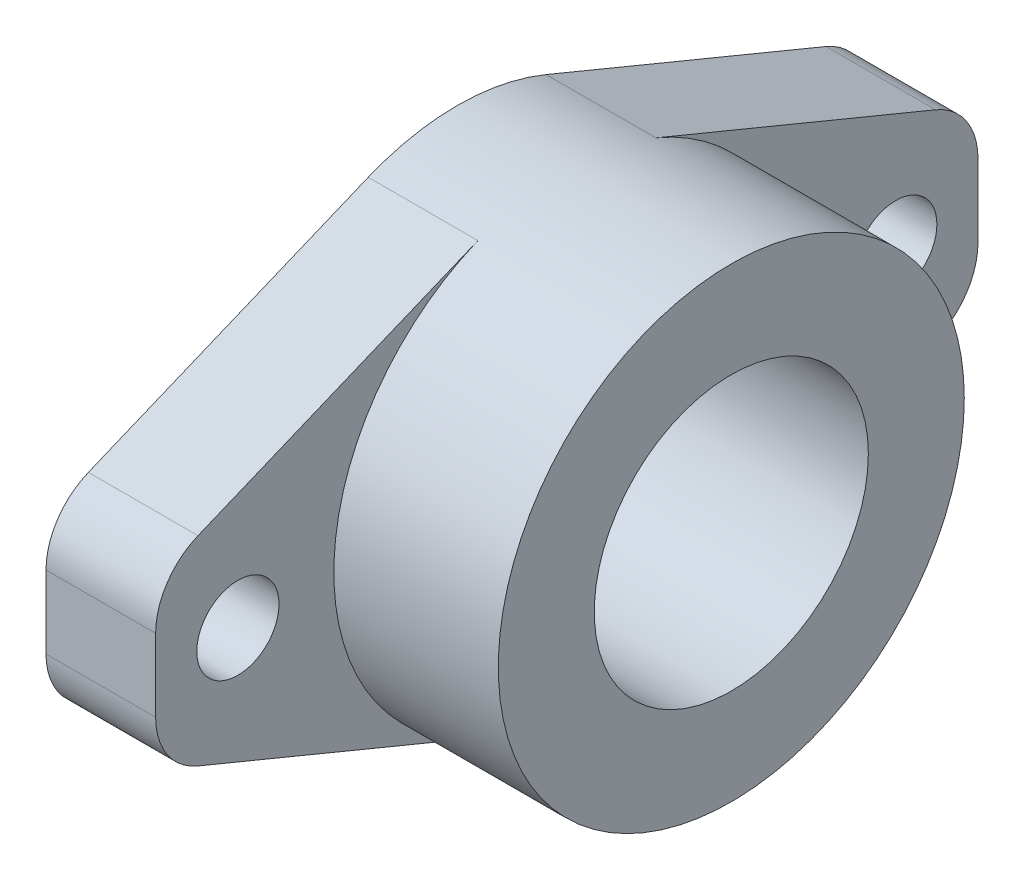
ISO-10303-21;
HEADER;
FILE_DESCRIPTION(('STEP AP214'),'2;1');
FILE_NAME('part.step','',(''),(''),'','','');
FILE_SCHEMA(('AUTOMOTIVE_DESIGN { 1 0 10303 214 1 1 1 1 }'));
ENDSEC;
DATA;
#1=APPLICATION_CONTEXT('core data for automotive mechanical design processes');
#2=APPLICATION_PROTOCOL_DEFINITION('international standard','automotive_design',2000,#1);
#3=PRODUCT_CONTEXT('',#1,'mechanical');
#4=PRODUCT('Part','Part','',(#3));
#5=PRODUCT_RELATED_PRODUCT_CATEGORY('part','',(#4));
#6=PRODUCT_DEFINITION_FORMATION('','',#4);
#7=PRODUCT_DEFINITION_CONTEXT('part definition',#1,'design');
#8=PRODUCT_DEFINITION('design','',#6,#7);
#9=PRODUCT_DEFINITION_SHAPE('','',#8);
#10=(LENGTH_UNIT() NAMED_UNIT(*) SI_UNIT(.MILLI.,.METRE.));
#11=(NAMED_UNIT(*) PLANE_ANGLE_UNIT() SI_UNIT($,.RADIAN.));
#12=(NAMED_UNIT(*) SI_UNIT($,.STERADIAN.) SOLID_ANGLE_UNIT());
#13=UNCERTAINTY_MEASURE_WITH_UNIT(LENGTH_MEASURE(1.E-05),#10,'distance_accuracy_value','');
#14=(GEOMETRIC_REPRESENTATION_CONTEXT(3) GLOBAL_UNCERTAINTY_ASSIGNED_CONTEXT((#13)) GLOBAL_UNIT_ASSIGNED_CONTEXT((#10,
#11,#12)) REPRESENTATION_CONTEXT('',''));
#15=CARTESIAN_POINT('',(0.,0.,0.));
#16=DIRECTION('',(0.,0.,1.));
#17=DIRECTION('',(1.,0.,0.));
#18=AXIS2_PLACEMENT_3D('',#15,#16,#17);
#19=CARTESIAN_POINT('',(8.,0.,0.));
#20=DIRECTION('',(1.,0.,0.));
#21=DIRECTION('',(0.,0.,-1.));
#22=AXIS2_PLACEMENT_3D('',#19,#20,#21);
#23=PLANE('',#22);
#24=CARTESIAN_POINT('',(8.,0.,24.));
#25=DIRECTION('',(1.,0.,0.));
#26=DIRECTION('',(0.,0.,-1.));
#27=AXIS2_PLACEMENT_3D('',#24,#25,#26);
#28=CIRCLE('',#27,3.);
#29=CARTESIAN_POINT('',(8.,0.,21.));
#30=VERTEX_POINT('',#29);
#31=EDGE_CURVE('E249',#30,#30,#28,.T.);
#32=ORIENTED_EDGE('',*,*,#31,.F.);
#33=EDGE_LOOP('',(#32));
#34=FACE_BOUND('',#33,.T.);
#35=DIRECTION('',(0.,-1.,0.));
#36=VECTOR('',#35,1.);
#37=CARTESIAN_POINT('',(8.,-6.,30.));
#38=LINE('',#37,#36);
#39=CARTESIAN_POINT('',(8.,2.65572396979215,30.));
#40=VERTEX_POINT('',#39);
#41=CARTESIAN_POINT('',(8.,-2.65572396979215,30.));
#42=VERTEX_POINT('',#41);
#43=EDGE_CURVE('E214',#40,#42,#38,.T.);
#44=ORIENTED_EDGE('',*,*,#43,.T.);
#45=CARTESIAN_POINT('',(8.,-2.65572396979215,25.));
#46=DIRECTION('',(1.,0.,0.));
#47=DIRECTION('',(0.,0.,-1.));
#48=AXIS2_PLACEMENT_3D('',#45,#46,#47);
#49=CIRCLE('',#48,5.);
#50=CARTESIAN_POINT('',(8.,-7.27690901529757,26.9090963242322));
#51=VERTEX_POINT('',#50);
#52=EDGE_CURVE('E176',#42,#51,#49,.T.);
#53=ORIENTED_EDGE('',*,*,#52,.T.);
#54=DIRECTION('',(0.,-0.38181926484645,-0.924237009101084));
#55=VECTOR('',#54,1.);
#56=CARTESIAN_POINT('',(8.,-6.,30.));
#57=LINE('',#56,#55);
#58=CARTESIAN_POINT('',(8.,-15.7120291547184,6.49092750238964));
#59=VERTEX_POINT('',#58);
#60=EDGE_CURVE('E220',#51,#59,#57,.T.);
#61=ORIENTED_EDGE('',*,*,#60,.T.);
#62=CARTESIAN_POINT('',(8.,0.,0.));
#63=DIRECTION('',(1.,0.,0.));
#64=DIRECTION('',(0.,0.,-1.));
#65=AXIS2_PLACEMENT_3D('',#62,#63,#64);
#66=CIRCLE('',#65,17.);
#67=CARTESIAN_POINT('',(8.,15.7120291547184,6.49092750238966));
#68=VERTEX_POINT('',#67);
#69=EDGE_CURVE('E143',#59,#68,#66,.F.);
#70=ORIENTED_EDGE('',*,*,#69,.T.);
#71=DIRECTION('',(0.,-0.38181926484645,0.924237009101084));
#72=VECTOR('',#71,1.);
#73=CARTESIAN_POINT('',(8.,6.,30.));
#74=LINE('',#73,#72);
#75=CARTESIAN_POINT('',(8.,7.27690901529756,26.9090963242322));
#76=VERTEX_POINT('',#75);
#77=EDGE_CURVE('E211',#68,#76,#74,.T.);
#78=ORIENTED_EDGE('',*,*,#77,.T.);
#79=CARTESIAN_POINT('',(8.,2.65572396979215,25.));
#80=DIRECTION('',(1.,0.,0.));
#81=DIRECTION('',(0.,0.,-1.));
#82=AXIS2_PLACEMENT_3D('',#79,#80,#81);
#83=CIRCLE('',#82,5.);
#84=EDGE_CURVE('E174',#76,#40,#83,.T.);
#85=ORIENTED_EDGE('',*,*,#84,.T.);
#86=EDGE_LOOP('',(#44,#53,#61,#70,#78,#85));
#87=FACE_BOUND('',#86,.T.);
#88=ADVANCED_FACE('F32',(#34,#87),#23,.T.);
#89=CARTESIAN_POINT('',(8.,0.,-24.));
#90=DIRECTION('',(1.,0.,0.));
#91=DIRECTION('',(0.,0.,-1.));
#92=AXIS2_PLACEMENT_3D('',#89,#90,#91);
#93=CIRCLE('',#92,3.);
#94=CARTESIAN_POINT('',(8.,0.,-27.));
#95=VERTEX_POINT('',#94);
#96=EDGE_CURVE('E241',#95,#95,#93,.T.);
#97=ORIENTED_EDGE('',*,*,#96,.F.);
#98=EDGE_LOOP('',(#97));
#99=FACE_BOUND('',#98,.T.);
#100=DIRECTION('',(0.,1.,0.));
#101=VECTOR('',#100,1.);
#102=CARTESIAN_POINT('',(8.,-6.,-30.));
#103=LINE('',#102,#101);
#104=CARTESIAN_POINT('',(8.,-2.65572396979215,-30.));
#105=VERTEX_POINT('',#104);
#106=CARTESIAN_POINT('',(8.,2.65572396979215,-30.));
#107=VERTEX_POINT('',#106);
#108=EDGE_CURVE('E133',#105,#107,#103,.T.);
#109=ORIENTED_EDGE('',*,*,#108,.T.);
#110=CARTESIAN_POINT('',(8.,2.65572396979215,-25.));
#111=DIRECTION('',(1.,0.,0.));
#112=DIRECTION('',(0.,0.,-1.));
#113=AXIS2_PLACEMENT_3D('',#110,#111,#112);
#114=CIRCLE('',#113,5.);
#115=CARTESIAN_POINT('',(8.,7.27690901529757,-26.9090963242323));
#116=VERTEX_POINT('',#115);
#117=EDGE_CURVE('E40',#107,#116,#114,.T.);
#118=ORIENTED_EDGE('',*,*,#117,.T.);
#119=DIRECTION('',(0.,0.38181926484645,0.924237009101084));
#120=VECTOR('',#119,1.);
#121=CARTESIAN_POINT('',(8.,6.,-30.));
#122=LINE('',#121,#120);
#123=CARTESIAN_POINT('',(8.,15.7120291547184,-6.49092750238965));
#124=VERTEX_POINT('',#123);
#125=EDGE_CURVE('E122',#116,#124,#122,.T.);
#126=ORIENTED_EDGE('',*,*,#125,.T.);
#127=CARTESIAN_POINT('',(8.,-15.7120291547184,-6.49092750238965));
#128=VERTEX_POINT('',#127);
#129=EDGE_CURVE('E125',#124,#128,#66,.F.);
#130=ORIENTED_EDGE('',*,*,#129,.T.);
#131=DIRECTION('',(0.,0.38181926484645,-0.924237009101083));
#132=VECTOR('',#131,1.);
#133=CARTESIAN_POINT('',(8.,-6.,-30.));
#134=LINE('',#133,#132);
#135=CARTESIAN_POINT('',(8.,-7.27690901529756,-26.9090963242323));
#136=VERTEX_POINT('',#135);
#137=EDGE_CURVE('E188',#128,#136,#134,.T.);
#138=ORIENTED_EDGE('',*,*,#137,.T.);
#139=CARTESIAN_POINT('',(8.,-2.65572396979215,-25.));
#140=DIRECTION('',(1.,0.,0.));
#141=DIRECTION('',(0.,0.,-1.));
#142=AXIS2_PLACEMENT_3D('',#139,#140,#141);
#143=CIRCLE('',#142,5.);
#144=EDGE_CURVE('E186',#136,#105,#143,.T.);
#145=ORIENTED_EDGE('',*,*,#144,.T.);
#146=EDGE_LOOP('',(#109,#118,#126,#130,#138,#145));
#147=FACE_BOUND('',#146,.T.);
#148=ADVANCED_FACE('F124',(#99,#147),#23,.T.);
#149=CARTESIAN_POINT('',(0.,0.,0.));
#150=DIRECTION('',(1.,0.,0.));
#151=DIRECTION('',(0.,0.,-1.));
#152=AXIS2_PLACEMENT_3D('',#149,#150,#151);
#153=PLANE('',#152);
#154=DIRECTION('',(0.,-0.38181926484645,-0.924237009101084));
#155=VECTOR('',#154,1.);
#156=CARTESIAN_POINT('',(0.,-6.,30.));
#157=LINE('',#156,#155);
#158=CARTESIAN_POINT('',(0.,-7.27690901529757,26.9090963242322));
#159=VERTEX_POINT('',#158);
#160=CARTESIAN_POINT('',(0.,-15.7120291547184,6.49092750238964));
#161=VERTEX_POINT('',#160);
#162=EDGE_CURVE('E206',#159,#161,#157,.T.);
#163=ORIENTED_EDGE('',*,*,#162,.F.);
#164=CARTESIAN_POINT('',(0.,-2.65572396979215,25.));
#165=DIRECTION('',(1.,0.,0.));
#166=DIRECTION('',(0.,0.,-1.));
#167=AXIS2_PLACEMENT_3D('',#164,#165,#166);
#168=CIRCLE('',#167,5.);
#169=CARTESIAN_POINT('',(0.,-2.65572396979215,30.));
#170=VERTEX_POINT('',#169);
#171=EDGE_CURVE('E167',#159,#170,#168,.F.);
#172=ORIENTED_EDGE('',*,*,#171,.T.);
#173=DIRECTION('',(0.,-1.,0.));
#174=VECTOR('',#173,1.);
#175=CARTESIAN_POINT('',(0.,-6.,30.));
#176=LINE('',#175,#174);
#177=CARTESIAN_POINT('',(0.,2.65572396979215,30.));
#178=VERTEX_POINT('',#177);
#179=EDGE_CURVE('E231',#178,#170,#176,.T.);
#180=ORIENTED_EDGE('',*,*,#179,.F.);
#181=CARTESIAN_POINT('',(0.,2.65572396979215,25.));
#182=DIRECTION('',(1.,0.,0.));
#183=DIRECTION('',(0.,0.,-1.));
#184=AXIS2_PLACEMENT_3D('',#181,#182,#183);
#185=CIRCLE('',#184,5.);
#186=CARTESIAN_POINT('',(0.,7.27690901529756,26.9090963242322));
#187=VERTEX_POINT('',#186);
#188=EDGE_CURVE('E165',#178,#187,#185,.F.);
#189=ORIENTED_EDGE('',*,*,#188,.T.);
#190=DIRECTION('',(0.,-0.38181926484645,0.924237009101084));
#191=VECTOR('',#190,1.);
#192=CARTESIAN_POINT('',(0.,6.,30.));
#193=LINE('',#192,#191);
#194=CARTESIAN_POINT('',(0.,15.7120291547184,6.49092750238965));
#195=VERTEX_POINT('',#194);
#196=EDGE_CURVE('E228',#195,#187,#193,.T.);
#197=ORIENTED_EDGE('',*,*,#196,.F.);
#198=CARTESIAN_POINT('',(0.,0.,0.));
#199=DIRECTION('',(1.,0.,0.));
#200=DIRECTION('',(0.,0.,-1.));
#201=AXIS2_PLACEMENT_3D('',#198,#199,#200);
#202=CIRCLE('',#201,17.);
#203=CARTESIAN_POINT('',(0.,15.7120291547184,-6.49092750238965));
#204=VERTEX_POINT('',#203);
#205=EDGE_CURVE('E210',#204,#195,#202,.T.);
#206=ORIENTED_EDGE('',*,*,#205,.F.);
#207=DIRECTION('',(0.,0.38181926484645,0.924237009101084));
#208=VECTOR('',#207,1.);
#209=CARTESIAN_POINT('',(0.,6.,-30.));
#210=LINE('',#209,#208);
#211=CARTESIAN_POINT('',(0.,7.27690901529757,-26.9090963242323));
#212=VERTEX_POINT('',#211);
#213=EDGE_CURVE('E148',#212,#204,#210,.T.);
#214=ORIENTED_EDGE('',*,*,#213,.F.);
#215=CARTESIAN_POINT('',(0.,2.65572396979215,-25.));
#216=DIRECTION('',(1.,0.,0.));
#217=DIRECTION('',(0.,0.,-1.));
#218=AXIS2_PLACEMENT_3D('',#215,#216,#217);
#219=CIRCLE('',#218,5.);
#220=CARTESIAN_POINT('',(0.,2.65572396979215,-30.));
#221=VERTEX_POINT('',#220);
#222=EDGE_CURVE('E163',#212,#221,#219,.F.);
#223=ORIENTED_EDGE('',*,*,#222,.T.);
#224=DIRECTION('',(0.,1.,0.));
#225=VECTOR('',#224,1.);
#226=CARTESIAN_POINT('',(0.,-6.,-30.));
#227=LINE('',#226,#225);
#228=CARTESIAN_POINT('',(0.,-2.65572396979215,-30.));
#229=VERTEX_POINT('',#228);
#230=EDGE_CURVE('E201',#229,#221,#227,.T.);
#231=ORIENTED_EDGE('',*,*,#230,.F.);
#232=CARTESIAN_POINT('',(0.,-2.65572396979215,-25.));
#233=DIRECTION('',(1.,0.,0.));
#234=DIRECTION('',(0.,0.,-1.));
#235=AXIS2_PLACEMENT_3D('',#232,#233,#234);
#236=CIRCLE('',#235,5.);
#237=CARTESIAN_POINT('',(0.,-7.27690901529756,-26.9090963242323));
#238=VERTEX_POINT('',#237);
#239=EDGE_CURVE('E161',#229,#238,#236,.F.);
#240=ORIENTED_EDGE('',*,*,#239,.T.);
#241=DIRECTION('',(0.,0.38181926484645,-0.924237009101083));
#242=VECTOR('',#241,1.);
#243=CARTESIAN_POINT('',(0.,-6.,-30.));
#244=LINE('',#243,#242);
#245=CARTESIAN_POINT('',(0.,-15.7120291547184,-6.49092750238965));
#246=VERTEX_POINT('',#245);
#247=EDGE_CURVE('E200',#246,#238,#244,.T.);
#248=ORIENTED_EDGE('',*,*,#247,.F.);
#249=CARTESIAN_POINT('',(0.,0.,0.));
#250=DIRECTION('',(1.,0.,0.));
#251=DIRECTION('',(0.,0.,-1.));
#252=AXIS2_PLACEMENT_3D('',#249,#250,#251);
#253=CIRCLE('',#252,17.);
#254=EDGE_CURVE('E203',#161,#246,#253,.T.);
#255=ORIENTED_EDGE('',*,*,#254,.F.);
#256=EDGE_LOOP('',(#163,#172,#180,#189,#197,#206,#214,#223,#231,#240,#248,#255));
#257=FACE_BOUND('',#256,.T.);
#258=CARTESIAN_POINT('',(0.,0.,0.));
#259=DIRECTION('',(1.,0.,0.));
#260=DIRECTION('',(0.,0.,-1.));
#261=AXIS2_PLACEMENT_3D('',#258,#259,#260);
#262=CIRCLE('',#261,10.);
#263=CARTESIAN_POINT('',(0.,0.,-10.));
#264=VERTEX_POINT('',#263);
#265=EDGE_CURVE('E223',#264,#264,#262,.T.);
#266=ORIENTED_EDGE('',*,*,#265,.T.);
#267=EDGE_LOOP('',(#266));
#268=FACE_BOUND('',#267,.T.);
#269=CARTESIAN_POINT('',(0.,0.,-24.));
#270=DIRECTION('',(1.,0.,0.));
#271=DIRECTION('',(0.,0.,-1.));
#272=AXIS2_PLACEMENT_3D('',#269,#270,#271);
#273=CIRCLE('',#272,3.);
#274=CARTESIAN_POINT('',(0.,0.,-27.));
#275=VERTEX_POINT('',#274);
#276=EDGE_CURVE('E239',#275,#275,#273,.T.);
#277=ORIENTED_EDGE('',*,*,#276,.T.);
#278=EDGE_LOOP('',(#277));
#279=FACE_BOUND('',#278,.T.);
#280=CARTESIAN_POINT('',(0.,0.,24.));
#281=DIRECTION('',(1.,0.,0.));
#282=DIRECTION('',(0.,0.,-1.));
#283=AXIS2_PLACEMENT_3D('',#280,#281,#282);
#284=CIRCLE('',#283,3.);
#285=CARTESIAN_POINT('',(0.,0.,21.));
#286=VERTEX_POINT('',#285);
#287=EDGE_CURVE('E247',#286,#286,#284,.T.);
#288=ORIENTED_EDGE('',*,*,#287,.T.);
#289=EDGE_LOOP('',(#288));
#290=FACE_BOUND('',#289,.T.);
#291=ADVANCED_FACE('F197',(#257,#268,#279,#290),#153,.F.);
#292=CARTESIAN_POINT('',(8.,6.,30.));
#293=DIRECTION('',(0.,-0.924237009101084,-0.38181926484645));
#294=DIRECTION('',(0.,0.38181926484645,-0.924237009101084));
#295=AXIS2_PLACEMENT_3D('',#292,#293,#294);
#296=PLANE('',#295);
#297=ORIENTED_EDGE('',*,*,#196,.T.);
#298=DIRECTION('',(-1.,0.,0.));
#299=VECTOR('',#298,1.);
#300=CARTESIAN_POINT('',(8.,7.27690901529756,26.9090963242322));
#301=LINE('',#300,#299);
#302=EDGE_CURVE('E178',#187,#76,#301,.F.);
#303=ORIENTED_EDGE('',*,*,#302,.T.);
#304=ORIENTED_EDGE('',*,*,#77,.F.);
#305=DIRECTION('',(-1.,0.,0.));
#306=VECTOR('',#305,1.);
#307=CARTESIAN_POINT('',(8.,15.7120291547184,6.49092750238965));
#308=LINE('',#307,#306);
#309=EDGE_CURVE('E132',#68,#195,#308,.T.);
#310=ORIENTED_EDGE('',*,*,#309,.T.);
#311=EDGE_LOOP('',(#297,#303,#304,#310));
#312=FACE_BOUND('',#311,.T.);
#313=ADVANCED_FACE('F281',(#312),#296,.F.);
#314=CARTESIAN_POINT('',(8.,-6.,30.));
#315=DIRECTION('',(0.,0.,-1.));
#316=DIRECTION('',(-1.,0.,0.));
#317=AXIS2_PLACEMENT_3D('',#314,#315,#316);
#318=PLANE('',#317);
#319=ORIENTED_EDGE('',*,*,#179,.T.);
#320=DIRECTION('',(-1.,0.,0.));
#321=VECTOR('',#320,1.);
#322=CARTESIAN_POINT('',(8.,-2.65572396979215,30.));
#323=LINE('',#322,#321);
#324=EDGE_CURVE('E172',#170,#42,#323,.F.);
#325=ORIENTED_EDGE('',*,*,#324,.T.);
#326=ORIENTED_EDGE('',*,*,#43,.F.);
#327=DIRECTION('',(-1.,0.,0.));
#328=VECTOR('',#327,1.);
#329=CARTESIAN_POINT('',(8.,2.65572396979215,30.));
#330=LINE('',#329,#328);
#331=EDGE_CURVE('E169',#40,#178,#330,.T.);
#332=ORIENTED_EDGE('',*,*,#331,.T.);
#333=EDGE_LOOP('',(#319,#325,#326,#332));
#334=FACE_BOUND('',#333,.T.);
#335=ADVANCED_FACE('F292',(#334),#318,.F.);
#336=CARTESIAN_POINT('',(8.,-6.,30.));
#337=DIRECTION('',(0.,0.924237009101084,-0.38181926484645));
#338=DIRECTION('',(0.,0.38181926484645,0.924237009101084));
#339=AXIS2_PLACEMENT_3D('',#336,#337,#338);
#340=PLANE('',#339);
#341=ORIENTED_EDGE('',*,*,#60,.F.);
#342=DIRECTION('',(-1.,0.,0.));
#343=VECTOR('',#342,1.);
#344=CARTESIAN_POINT('',(8.,-7.27690901529757,26.9090963242322));
#345=LINE('',#344,#343);
#346=EDGE_CURVE('E158',#51,#159,#345,.T.);
#347=ORIENTED_EDGE('',*,*,#346,.T.);
#348=ORIENTED_EDGE('',*,*,#162,.T.);
#349=DIRECTION('',(-1.,0.,0.));
#350=VECTOR('',#349,1.);
#351=CARTESIAN_POINT('',(8.,-15.7120291547184,6.49092750238964));
#352=LINE('',#351,#350);
#353=EDGE_CURVE('E150',#59,#161,#352,.T.);
#354=ORIENTED_EDGE('',*,*,#353,.F.);
#355=EDGE_LOOP('',(#341,#347,#348,#354));
#356=FACE_BOUND('',#355,.T.);
#357=ADVANCED_FACE('F236',(#356),#340,.F.);
#358=CARTESIAN_POINT('',(8.,-6.,-30.));
#359=DIRECTION('',(0.,0.924237009101084,0.38181926484645));
#360=DIRECTION('',(0.,-0.38181926484645,0.924237009101083));
#361=AXIS2_PLACEMENT_3D('',#358,#359,#360);
#362=PLANE('',#361);
#363=ORIENTED_EDGE('',*,*,#247,.T.);
#364=DIRECTION('',(-1.,0.,0.));
#365=VECTOR('',#364,1.);
#366=CARTESIAN_POINT('',(8.,-7.27690901529756,-26.9090963242323));
#367=LINE('',#366,#365);
#368=EDGE_CURVE('E11',#238,#136,#367,.F.);
#369=ORIENTED_EDGE('',*,*,#368,.T.);
#370=ORIENTED_EDGE('',*,*,#137,.F.);
#371=DIRECTION('',(-1.,0.,0.));
#372=VECTOR('',#371,1.);
#373=CARTESIAN_POINT('',(8.,-15.7120291547184,-6.49092750238965));
#374=LINE('',#373,#372);
#375=EDGE_CURVE('E142',#128,#246,#374,.T.);
#376=ORIENTED_EDGE('',*,*,#375,.T.);
#377=EDGE_LOOP('',(#363,#369,#370,#376));
#378=FACE_BOUND('',#377,.T.);
#379=ADVANCED_FACE('F202',(#378),#362,.F.);
#380=CARTESIAN_POINT('',(8.,-6.,-30.));
#381=DIRECTION('',(0.,0.,1.));
#382=DIRECTION('',(1.,0.,0.));
#383=AXIS2_PLACEMENT_3D('',#380,#381,#382);
#384=PLANE('',#383);
#385=ORIENTED_EDGE('',*,*,#230,.T.);
#386=DIRECTION('',(-1.,0.,0.));
#387=VECTOR('',#386,1.);
#388=CARTESIAN_POINT('',(8.,2.65572396979215,-30.));
#389=LINE('',#388,#387);
#390=EDGE_CURVE('E53',#221,#107,#389,.F.);
#391=ORIENTED_EDGE('',*,*,#390,.T.);
#392=ORIENTED_EDGE('',*,*,#108,.F.);
#393=DIRECTION('',(-1.,0.,0.));
#394=VECTOR('',#393,1.);
#395=CARTESIAN_POINT('',(8.,-2.65572396979215,-30.));
#396=LINE('',#395,#394);
#397=EDGE_CURVE('E182',#105,#229,#396,.T.);
#398=ORIENTED_EDGE('',*,*,#397,.T.);
#399=EDGE_LOOP('',(#385,#391,#392,#398));
#400=FACE_BOUND('',#399,.T.);
#401=ADVANCED_FACE('F191',(#400),#384,.F.);
#402=CARTESIAN_POINT('',(8.,6.,-30.));
#403=DIRECTION('',(0.,-0.924237009101084,0.38181926484645));
#404=DIRECTION('',(0.,-0.38181926484645,-0.924237009101084));
#405=AXIS2_PLACEMENT_3D('',#402,#403,#404);
#406=PLANE('',#405);
#407=ORIENTED_EDGE('',*,*,#125,.F.);
#408=DIRECTION('',(-1.,0.,0.));
#409=VECTOR('',#408,1.);
#410=CARTESIAN_POINT('',(8.,7.27690901529757,-26.9090963242323));
#411=LINE('',#410,#409);
#412=EDGE_CURVE('E180',#116,#212,#411,.T.);
#413=ORIENTED_EDGE('',*,*,#412,.T.);
#414=ORIENTED_EDGE('',*,*,#213,.T.);
#415=DIRECTION('',(-1.,0.,0.));
#416=VECTOR('',#415,1.);
#417=CARTESIAN_POINT('',(8.,15.7120291547184,-6.49092750238965));
#418=LINE('',#417,#416);
#419=EDGE_CURVE('E139',#124,#204,#418,.T.);
#420=ORIENTED_EDGE('',*,*,#419,.F.);
#421=EDGE_LOOP('',(#407,#413,#414,#420));
#422=FACE_BOUND('',#421,.T.);
#423=ADVANCED_FACE('F146',(#422),#406,.F.);
#424=CARTESIAN_POINT('',(8.,0.,0.));
#425=DIRECTION('',(-1.,0.,0.));
#426=DIRECTION('',(0.,0.,1.));
#427=AXIS2_PLACEMENT_3D('',#424,#425,#426);
#428=CYLINDRICAL_SURFACE('',#427,17.);
#429=ORIENTED_EDGE('',*,*,#205,.T.);
#430=ORIENTED_EDGE('',*,*,#309,.F.);
#431=ORIENTED_EDGE('',*,*,#69,.F.);
#432=ORIENTED_EDGE('',*,*,#353,.T.);
#433=ORIENTED_EDGE('',*,*,#254,.T.);
#434=ORIENTED_EDGE('',*,*,#375,.F.);
#435=ORIENTED_EDGE('',*,*,#129,.F.);
#436=ORIENTED_EDGE('',*,*,#419,.T.);
#437=EDGE_LOOP('',(#429,#430,#431,#432,#433,#434,#435,#436));
#438=FACE_BOUND('',#437,.T.);
#439=CARTESIAN_POINT('',(20.,0.,0.));
#440=DIRECTION('',(1.,0.,0.));
#441=DIRECTION('',(0.,0.,-1.));
#442=AXIS2_PLACEMENT_3D('',#439,#440,#441);
#443=CIRCLE('',#442,17.);
#444=CARTESIAN_POINT('',(20.,0.,-17.));
#445=VERTEX_POINT('',#444);
#446=EDGE_CURVE('E144',#445,#445,#443,.T.);
#447=ORIENTED_EDGE('',*,*,#446,.F.);
#448=EDGE_LOOP('',(#447));
#449=FACE_BOUND('',#448,.T.);
#450=ADVANCED_FACE('F137',(#438,#449),#428,.T.);
#451=CARTESIAN_POINT('',(8.,0.,0.));
#452=DIRECTION('',(-1.,0.,0.));
#453=DIRECTION('',(0.,0.,1.));
#454=AXIS2_PLACEMENT_3D('',#451,#452,#453);
#455=CYLINDRICAL_SURFACE('',#454,10.);
#456=ORIENTED_EDGE('',*,*,#265,.F.);
#457=EDGE_LOOP('',(#456));
#458=FACE_BOUND('',#457,.T.);
#459=CARTESIAN_POINT('',(20.,0.,0.));
#460=DIRECTION('',(1.,0.,0.));
#461=DIRECTION('',(0.,0.,-1.));
#462=AXIS2_PLACEMENT_3D('',#459,#460,#461);
#463=CIRCLE('',#462,10.);
#464=CARTESIAN_POINT('',(20.,0.,-10.));
#465=VERTEX_POINT('',#464);
#466=EDGE_CURVE('E438',#465,#465,#463,.T.);
#467=ORIENTED_EDGE('',*,*,#466,.T.);
#468=EDGE_LOOP('',(#467));
#469=FACE_BOUND('',#468,.T.);
#470=ADVANCED_FACE('F258',(#458,#469),#455,.F.);
#471=CARTESIAN_POINT('',(8.,0.,24.));
#472=DIRECTION('',(-1.,0.,0.));
#473=DIRECTION('',(0.,0.,1.));
#474=AXIS2_PLACEMENT_3D('',#471,#472,#473);
#475=CYLINDRICAL_SURFACE('',#474,3.);
#476=ORIENTED_EDGE('',*,*,#31,.T.);
#477=EDGE_LOOP('',(#476));
#478=FACE_BOUND('',#477,.T.);
#479=ORIENTED_EDGE('',*,*,#287,.F.);
#480=EDGE_LOOP('',(#479));
#481=FACE_BOUND('',#480,.T.);
#482=ADVANCED_FACE('F255',(#478,#481),#475,.F.);
#483=CARTESIAN_POINT('',(8.,0.,-24.));
#484=DIRECTION('',(-1.,0.,0.));
#485=DIRECTION('',(0.,0.,1.));
#486=AXIS2_PLACEMENT_3D('',#483,#484,#485);
#487=CYLINDRICAL_SURFACE('',#486,3.);
#488=ORIENTED_EDGE('',*,*,#96,.T.);
#489=EDGE_LOOP('',(#488));
#490=FACE_BOUND('',#489,.T.);
#491=ORIENTED_EDGE('',*,*,#276,.F.);
#492=EDGE_LOOP('',(#491));
#493=FACE_BOUND('',#492,.T.);
#494=ADVANCED_FACE('F257',(#490,#493),#487,.F.);
#495=CARTESIAN_POINT('',(20.,0.,0.));
#496=DIRECTION('',(1.,0.,0.));
#497=DIRECTION('',(0.,0.,-1.));
#498=AXIS2_PLACEMENT_3D('',#495,#496,#497);
#499=PLANE('',#498);
#500=ORIENTED_EDGE('',*,*,#446,.T.);
#501=EDGE_LOOP('',(#500));
#502=FACE_BOUND('',#501,.T.);
#503=ORIENTED_EDGE('',*,*,#466,.F.);
#504=EDGE_LOOP('',(#503));
#505=FACE_BOUND('',#504,.T.);
#506=ADVANCED_FACE('F265',(#502,#505),#499,.T.);
#507=CARTESIAN_POINT('',(8.,-2.65572396979215,25.));
#508=DIRECTION('',(-1.,0.,0.));
#509=DIRECTION('',(0.,0.,1.));
#510=AXIS2_PLACEMENT_3D('',#507,#508,#509);
#511=CYLINDRICAL_SURFACE('',#510,5.);
#512=ORIENTED_EDGE('',*,*,#52,.F.);
#513=ORIENTED_EDGE('',*,*,#324,.F.);
#514=ORIENTED_EDGE('',*,*,#171,.F.);
#515=ORIENTED_EDGE('',*,*,#346,.F.);
#516=EDGE_LOOP('',(#512,#513,#514,#515));
#517=FACE_BOUND('',#516,.T.);
#518=ADVANCED_FACE('F299',(#517),#511,.T.);
#519=CARTESIAN_POINT('',(8.,2.65572396979215,25.));
#520=DIRECTION('',(-1.,0.,0.));
#521=DIRECTION('',(0.,0.,1.));
#522=AXIS2_PLACEMENT_3D('',#519,#520,#521);
#523=CYLINDRICAL_SURFACE('',#522,5.);
#524=ORIENTED_EDGE('',*,*,#84,.F.);
#525=ORIENTED_EDGE('',*,*,#302,.F.);
#526=ORIENTED_EDGE('',*,*,#188,.F.);
#527=ORIENTED_EDGE('',*,*,#331,.F.);
#528=EDGE_LOOP('',(#524,#525,#526,#527));
#529=FACE_BOUND('',#528,.T.);
#530=ADVANCED_FACE('F302',(#529),#523,.T.);
#531=CARTESIAN_POINT('',(8.,2.65572396979215,-25.));
#532=DIRECTION('',(-1.,0.,0.));
#533=DIRECTION('',(0.,0.,1.));
#534=AXIS2_PLACEMENT_3D('',#531,#532,#533);
#535=CYLINDRICAL_SURFACE('',#534,5.);
#536=ORIENTED_EDGE('',*,*,#117,.F.);
#537=ORIENTED_EDGE('',*,*,#390,.F.);
#538=ORIENTED_EDGE('',*,*,#222,.F.);
#539=ORIENTED_EDGE('',*,*,#412,.F.);
#540=EDGE_LOOP('',(#536,#537,#538,#539));
#541=FACE_BOUND('',#540,.T.);
#542=ADVANCED_FACE('F305',(#541),#535,.T.);
#543=CARTESIAN_POINT('',(8.,-2.65572396979215,-25.));
#544=DIRECTION('',(-1.,0.,0.));
#545=DIRECTION('',(0.,0.,1.));
#546=AXIS2_PLACEMENT_3D('',#543,#544,#545);
#547=CYLINDRICAL_SURFACE('',#546,5.);
#548=ORIENTED_EDGE('',*,*,#144,.F.);
#549=ORIENTED_EDGE('',*,*,#368,.F.);
#550=ORIENTED_EDGE('',*,*,#239,.F.);
#551=ORIENTED_EDGE('',*,*,#397,.F.);
#552=EDGE_LOOP('',(#548,#549,#550,#551));
#553=FACE_BOUND('',#552,.T.);
#554=ADVANCED_FACE('F34',(#553),#547,.T.);
#555=CLOSED_SHELL('',(#88,#148,#291,#313,#335,#357,#379,#401,#423,#450,#470,#482,#494,#506,#518,
#530,#542,#554));
#556=MANIFOLD_SOLID_BREP('B2',#555);
#557=ADVANCED_BREP_SHAPE_REPRESENTATION('',(#18,#556),#14);
#558=SHAPE_DEFINITION_REPRESENTATION(#9,#557);
ENDSEC;
END-ISO-10303-21;
